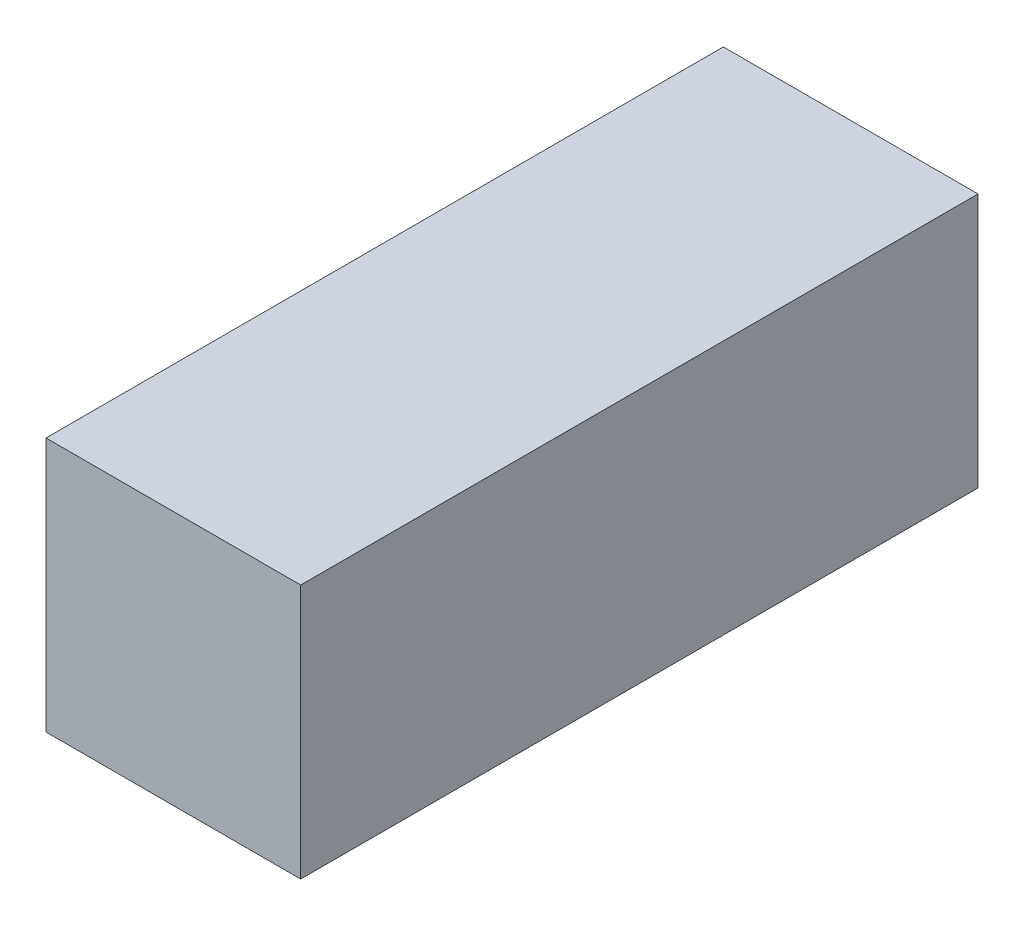
ISO-10303-21;
HEADER;
FILE_DESCRIPTION(('STEP AP214'),'2;1');
FILE_NAME('part.step','',(''),(''),'','','');
FILE_SCHEMA(('AUTOMOTIVE_DESIGN { 1 0 10303 214 1 1 1 1 }'));
ENDSEC;
DATA;
#1=APPLICATION_CONTEXT('core data for automotive mechanical design processes');
#2=APPLICATION_PROTOCOL_DEFINITION('international standard','automotive_design',2000,#1);
#3=PRODUCT_CONTEXT('',#1,'mechanical');
#4=PRODUCT('Part','Part','',(#3));
#5=PRODUCT_RELATED_PRODUCT_CATEGORY('part','',(#4));
#6=PRODUCT_DEFINITION_FORMATION('','',#4);
#7=PRODUCT_DEFINITION_CONTEXT('part definition',#1,'design');
#8=PRODUCT_DEFINITION('design','',#6,#7);
#9=PRODUCT_DEFINITION_SHAPE('','',#8);
#10=(LENGTH_UNIT() NAMED_UNIT(*) SI_UNIT(.MILLI.,.METRE.));
#11=(NAMED_UNIT(*) PLANE_ANGLE_UNIT() SI_UNIT($,.RADIAN.));
#12=(NAMED_UNIT(*) SI_UNIT($,.STERADIAN.) SOLID_ANGLE_UNIT());
#13=UNCERTAINTY_MEASURE_WITH_UNIT(LENGTH_MEASURE(1.E-05),#10,'distance_accuracy_value','');
#14=(GEOMETRIC_REPRESENTATION_CONTEXT(3) GLOBAL_UNCERTAINTY_ASSIGNED_CONTEXT((#13)) GLOBAL_UNIT_ASSIGNED_CONTEXT((#10,
#11,#12)) REPRESENTATION_CONTEXT('',''));
#15=CARTESIAN_POINT('',(0.,0.,0.));
#16=DIRECTION('',(0.,0.,1.));
#17=DIRECTION('',(1.,0.,0.));
#18=AXIS2_PLACEMENT_3D('',#15,#16,#17);
#19=CARTESIAN_POINT('',(0.,0.,12.7));
#20=DIRECTION('',(1.,0.,0.));
#21=DIRECTION('',(0.,0.,-1.));
#22=AXIS2_PLACEMENT_3D('',#19,#20,#21);
#23=PLANE('',#22);
#24=DIRECTION('',(0.,-1.,0.));
#25=VECTOR('',#24,1.);
#26=CARTESIAN_POINT('',(0.,0.,0.));
#27=LINE('',#26,#25);
#28=CARTESIAN_POINT('',(0.,4.7752,0.));
#29=VERTEX_POINT('',#28);
#30=CARTESIAN_POINT('',(0.,0.,0.));
#31=VERTEX_POINT('',#30);
#32=EDGE_CURVE('E107',#29,#31,#27,.T.);
#33=ORIENTED_EDGE('',*,*,#32,.T.);
#34=DIRECTION('',(0.,0.,-1.));
#35=VECTOR('',#34,1.);
#36=CARTESIAN_POINT('',(0.,0.,12.7));
#37=LINE('',#36,#35);
#38=CARTESIAN_POINT('',(0.,0.,12.7));
#39=VERTEX_POINT('',#38);
#40=EDGE_CURVE('E11',#39,#31,#37,.T.);
#41=ORIENTED_EDGE('',*,*,#40,.F.);
#42=DIRECTION('',(0.,-1.,0.));
#43=VECTOR('',#42,1.);
#44=CARTESIAN_POINT('',(0.,0.,12.7));
#45=LINE('',#44,#43);
#46=CARTESIAN_POINT('',(0.,4.7752,12.7));
#47=VERTEX_POINT('',#46);
#48=EDGE_CURVE('E91',#47,#39,#45,.T.);
#49=ORIENTED_EDGE('',*,*,#48,.F.);
#50=DIRECTION('',(0.,0.,-1.));
#51=VECTOR('',#50,1.);
#52=CARTESIAN_POINT('',(0.,4.7752,12.7));
#53=LINE('',#52,#51);
#54=EDGE_CURVE('E103',#47,#29,#53,.T.);
#55=ORIENTED_EDGE('',*,*,#54,.T.);
#56=EDGE_LOOP('',(#33,#41,#49,#55));
#57=FACE_BOUND('',#56,.T.);
#58=ADVANCED_FACE('F39',(#57),#23,.F.);
#59=CARTESIAN_POINT('',(0.,0.,12.7));
#60=DIRECTION('',(0.,1.,0.));
#61=DIRECTION('',(0.,0.,1.));
#62=AXIS2_PLACEMENT_3D('',#59,#60,#61);
#63=PLANE('',#62);
#64=DIRECTION('',(1.,0.,0.));
#65=VECTOR('',#64,1.);
#66=CARTESIAN_POINT('',(0.,0.,0.));
#67=LINE('',#66,#65);
#68=CARTESIAN_POINT('',(4.7752,0.,0.));
#69=VERTEX_POINT('',#68);
#70=EDGE_CURVE('E96',#31,#69,#67,.T.);
#71=ORIENTED_EDGE('',*,*,#70,.T.);
#72=DIRECTION('',(0.,0.,-1.));
#73=VECTOR('',#72,1.);
#74=CARTESIAN_POINT('',(4.7752,0.,12.7));
#75=LINE('',#74,#73);
#76=CARTESIAN_POINT('',(4.7752,0.,12.7));
#77=VERTEX_POINT('',#76);
#78=EDGE_CURVE('E48',#77,#69,#75,.T.);
#79=ORIENTED_EDGE('',*,*,#78,.F.);
#80=DIRECTION('',(1.,0.,0.));
#81=VECTOR('',#80,1.);
#82=CARTESIAN_POINT('',(0.,0.,12.7));
#83=LINE('',#82,#81);
#84=EDGE_CURVE('E86',#39,#77,#83,.T.);
#85=ORIENTED_EDGE('',*,*,#84,.F.);
#86=ORIENTED_EDGE('',*,*,#40,.T.);
#87=EDGE_LOOP('',(#71,#79,#85,#86));
#88=FACE_BOUND('',#87,.T.);
#89=ADVANCED_FACE('F95',(#88),#63,.F.);
#90=CARTESIAN_POINT('',(4.7752,0.,12.7));
#91=DIRECTION('',(-1.,0.,0.));
#92=DIRECTION('',(0.,0.,1.));
#93=AXIS2_PLACEMENT_3D('',#90,#91,#92);
#94=PLANE('',#93);
#95=DIRECTION('',(0.,1.,0.));
#96=VECTOR('',#95,1.);
#97=CARTESIAN_POINT('',(4.7752,0.,0.));
#98=LINE('',#97,#96);
#99=CARTESIAN_POINT('',(4.7752,4.7752,0.));
#100=VERTEX_POINT('',#99);
#101=EDGE_CURVE('E73',#69,#100,#98,.T.);
#102=ORIENTED_EDGE('',*,*,#101,.T.);
#103=DIRECTION('',(0.,0.,-1.));
#104=VECTOR('',#103,1.);
#105=CARTESIAN_POINT('',(4.7752,4.7752,12.7));
#106=LINE('',#105,#104);
#107=CARTESIAN_POINT('',(4.7752,4.7752,12.7));
#108=VERTEX_POINT('',#107);
#109=EDGE_CURVE('E98',#108,#100,#106,.T.);
#110=ORIENTED_EDGE('',*,*,#109,.F.);
#111=DIRECTION('',(0.,1.,0.));
#112=VECTOR('',#111,1.);
#113=CARTESIAN_POINT('',(4.7752,0.,12.7));
#114=LINE('',#113,#112);
#115=EDGE_CURVE('E89',#77,#108,#114,.T.);
#116=ORIENTED_EDGE('',*,*,#115,.F.);
#117=ORIENTED_EDGE('',*,*,#78,.T.);
#118=EDGE_LOOP('',(#102,#110,#116,#117));
#119=FACE_BOUND('',#118,.T.);
#120=ADVANCED_FACE('F99',(#119),#94,.F.);
#121=CARTESIAN_POINT('',(0.,4.7752,12.7));
#122=DIRECTION('',(0.,-1.,0.));
#123=DIRECTION('',(0.,0.,-1.));
#124=AXIS2_PLACEMENT_3D('',#121,#122,#123);
#125=PLANE('',#124);
#126=DIRECTION('',(-1.,0.,0.));
#127=VECTOR('',#126,1.);
#128=CARTESIAN_POINT('',(0.,4.7752,0.));
#129=LINE('',#128,#127);
#130=EDGE_CURVE('E79',#100,#29,#129,.T.);
#131=ORIENTED_EDGE('',*,*,#130,.T.);
#132=ORIENTED_EDGE('',*,*,#54,.F.);
#133=DIRECTION('',(-1.,0.,0.));
#134=VECTOR('',#133,1.);
#135=CARTESIAN_POINT('',(0.,4.7752,12.7));
#136=LINE('',#135,#134);
#137=EDGE_CURVE('E56',#108,#47,#136,.T.);
#138=ORIENTED_EDGE('',*,*,#137,.F.);
#139=ORIENTED_EDGE('',*,*,#109,.T.);
#140=EDGE_LOOP('',(#131,#132,#138,#139));
#141=FACE_BOUND('',#140,.T.);
#142=ADVANCED_FACE('F120',(#141),#125,.F.);
#143=CARTESIAN_POINT('',(0.,0.,12.7));
#144=DIRECTION('',(0.,0.,-1.));
#145=DIRECTION('',(-1.,0.,0.));
#146=AXIS2_PLACEMENT_3D('',#143,#144,#145);
#147=PLANE('',#146);
#148=ORIENTED_EDGE('',*,*,#48,.T.);
#149=ORIENTED_EDGE('',*,*,#84,.T.);
#150=ORIENTED_EDGE('',*,*,#115,.T.);
#151=ORIENTED_EDGE('',*,*,#137,.T.);
#152=EDGE_LOOP('',(#148,#149,#150,#151));
#153=FACE_BOUND('',#152,.T.);
#154=ADVANCED_FACE('F87',(#153),#147,.F.);
#155=CARTESIAN_POINT('',(0.,0.,0.));
#156=DIRECTION('',(0.,0.,-1.));
#157=DIRECTION('',(-1.,0.,0.));
#158=AXIS2_PLACEMENT_3D('',#155,#156,#157);
#159=PLANE('',#158);
#160=ORIENTED_EDGE('',*,*,#32,.F.);
#161=ORIENTED_EDGE('',*,*,#130,.F.);
#162=ORIENTED_EDGE('',*,*,#101,.F.);
#163=ORIENTED_EDGE('',*,*,#70,.F.);
#164=EDGE_LOOP('',(#160,#161,#162,#163));
#165=FACE_BOUND('',#164,.T.);
#166=ADVANCED_FACE('F123',(#165),#159,.T.);
#167=CLOSED_SHELL('',(#58,#89,#120,#142,#154,#166));
#168=MANIFOLD_SOLID_BREP('B2',#167);
#169=ADVANCED_BREP_SHAPE_REPRESENTATION('',(#18,#168),#14);
#170=SHAPE_DEFINITION_REPRESENTATION(#9,#169);
ENDSEC;
END-ISO-10303-21;
